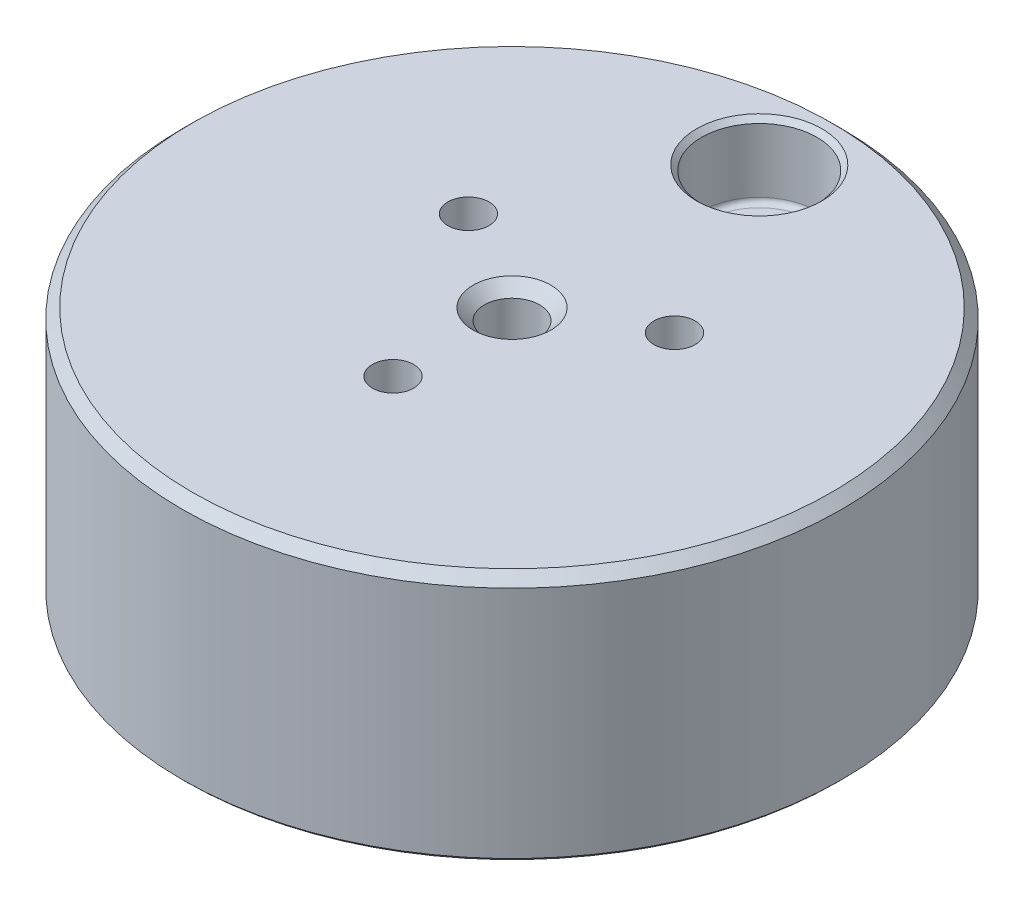
ISO-10303-21;
HEADER;
FILE_DESCRIPTION(('STEP AP214'),'2;1');
FILE_NAME('part.step','',(''),(''),'','','');
FILE_SCHEMA(('AUTOMOTIVE_DESIGN { 1 0 10303 214 1 1 1 1 }'));
ENDSEC;
DATA;
#1=APPLICATION_CONTEXT('core data for automotive mechanical design processes');
#2=APPLICATION_PROTOCOL_DEFINITION('international standard','automotive_design',2000,#1);
#3=PRODUCT_CONTEXT('',#1,'mechanical');
#4=PRODUCT('Part','Part','',(#3));
#5=PRODUCT_RELATED_PRODUCT_CATEGORY('part','',(#4));
#6=PRODUCT_DEFINITION_FORMATION('','',#4);
#7=PRODUCT_DEFINITION_CONTEXT('part definition',#1,'design');
#8=PRODUCT_DEFINITION('design','',#6,#7);
#9=PRODUCT_DEFINITION_SHAPE('','',#8);
#10=(LENGTH_UNIT() NAMED_UNIT(*) SI_UNIT(.MILLI.,.METRE.));
#11=(NAMED_UNIT(*) PLANE_ANGLE_UNIT() SI_UNIT($,.RADIAN.));
#12=(NAMED_UNIT(*) SI_UNIT($,.STERADIAN.) SOLID_ANGLE_UNIT());
#13=UNCERTAINTY_MEASURE_WITH_UNIT(LENGTH_MEASURE(1.E-05),#10,'distance_accuracy_value','');
#14=(GEOMETRIC_REPRESENTATION_CONTEXT(3) GLOBAL_UNCERTAINTY_ASSIGNED_CONTEXT((#13)) GLOBAL_UNIT_ASSIGNED_CONTEXT((#10,
#11,#12)) REPRESENTATION_CONTEXT('',''));
#15=CARTESIAN_POINT('',(0.,0.,0.));
#16=DIRECTION('',(0.,0.,1.));
#17=DIRECTION('',(1.,0.,0.));
#18=AXIS2_PLACEMENT_3D('',#15,#16,#17);
#19=CARTESIAN_POINT('',(50.8,38.1,0.));
#20=DIRECTION('',(0.,1.,0.));
#21=DIRECTION('',(0.,0.,1.));
#22=AXIS2_PLACEMENT_3D('',#19,#20,#21);
#23=PLANE('',#22);
#24=CARTESIAN_POINT('',(0.,38.1,-38.1));
#25=DIRECTION('',(0.,1.,0.));
#26=DIRECTION('',(0.,0.,1.));
#27=AXIS2_PLACEMENT_3D('',#24,#25,#26);
#28=CIRCLE('',#27,9.65199999999998);
#29=CARTESIAN_POINT('',(0.,38.1,-28.448));
#30=VERTEX_POINT('',#29);
#31=EDGE_CURVE('E128',#30,#30,#28,.F.);
#32=ORIENTED_EDGE('',*,*,#31,.T.);
#33=EDGE_LOOP('',(#32));
#34=FACE_BOUND('',#33,.T.);
#35=CARTESIAN_POINT('',(0.,38.1,0.));
#36=DIRECTION('',(0.,1.,0.));
#37=DIRECTION('',(0.,0.,1.));
#38=AXIS2_PLACEMENT_3D('',#35,#36,#37);
#39=CIRCLE('',#38,49.276);
#40=CARTESIAN_POINT('',(0.,38.1,49.276));
#41=VERTEX_POINT('',#40);
#42=EDGE_CURVE('E132',#41,#41,#39,.T.);
#43=ORIENTED_EDGE('',*,*,#42,.T.);
#44=EDGE_LOOP('',(#43));
#45=FACE_BOUND('',#44,.T.);
#46=CARTESIAN_POINT('',(0.,38.1,18.3308710467706));
#47=DIRECTION('',(0.,-1.,0.));
#48=DIRECTION('',(0.,0.,-1.));
#49=AXIS2_PLACEMENT_3D('',#46,#47,#48);
#50=CIRCLE('',#49,3.175);
#51=CARTESIAN_POINT('',(0.,38.1,15.1558710467706));
#52=VERTEX_POINT('',#51);
#53=EDGE_CURVE('E136',#52,#52,#50,.T.);
#54=ORIENTED_EDGE('',*,*,#53,.T.);
#55=EDGE_LOOP('',(#54));
#56=FACE_BOUND('',#55,.T.);
#57=CARTESIAN_POINT('',(15.875,38.1,-9.16543552338532));
#58=DIRECTION('',(0.,-1.,0.));
#59=DIRECTION('',(0.,0.,-1.));
#60=AXIS2_PLACEMENT_3D('',#57,#58,#59);
#61=CIRCLE('',#60,3.175);
#62=CARTESIAN_POINT('',(15.875,38.1,-12.3404355233853));
#63=VERTEX_POINT('',#62);
#64=EDGE_CURVE('E140',#63,#63,#61,.T.);
#65=ORIENTED_EDGE('',*,*,#64,.T.);
#66=EDGE_LOOP('',(#65));
#67=FACE_BOUND('',#66,.T.);
#68=CARTESIAN_POINT('',(-15.875,38.1,-9.16543552338531));
#69=DIRECTION('',(0.,-1.,0.));
#70=DIRECTION('',(0.,0.,-1.));
#71=AXIS2_PLACEMENT_3D('',#68,#69,#70);
#72=CIRCLE('',#71,3.175);
#73=CARTESIAN_POINT('',(-15.875,38.1,-12.3404355233853));
#74=VERTEX_POINT('',#73);
#75=EDGE_CURVE('E144',#74,#74,#72,.T.);
#76=ORIENTED_EDGE('',*,*,#75,.T.);
#77=EDGE_LOOP('',(#76));
#78=FACE_BOUND('',#77,.T.);
#79=CARTESIAN_POINT('',(0.,38.1,0.));
#80=DIRECTION('',(0.,1.,0.));
#81=DIRECTION('',(0.,0.,1.));
#82=AXIS2_PLACEMENT_3D('',#79,#80,#81);
#83=CIRCLE('',#82,6.);
#84=CARTESIAN_POINT('',(0.,38.1,6.));
#85=VERTEX_POINT('',#84);
#86=EDGE_CURVE('E81',#85,#85,#83,.T.);
#87=ORIENTED_EDGE('',*,*,#86,.F.);
#88=EDGE_LOOP('',(#87));
#89=FACE_BOUND('',#88,.T.);
#90=ADVANCED_FACE('F45',(#34,#45,#56,#67,#78,#89),#23,.T.);
#91=CARTESIAN_POINT('',(0.,0.,0.));
#92=DIRECTION('',(0.,-1.,0.));
#93=DIRECTION('',(0.,0.,-1.));
#94=AXIS2_PLACEMENT_3D('',#91,#92,#93);
#95=CYLINDRICAL_SURFACE('',#94,50.8);
#96=CARTESIAN_POINT('',(0.,0.508000000000002,0.));
#97=DIRECTION('',(0.,-1.,0.));
#98=DIRECTION('',(0.,0.,-1.));
#99=AXIS2_PLACEMENT_3D('',#96,#97,#98);
#100=CIRCLE('',#99,50.8);
#101=CARTESIAN_POINT('',(0.,0.508000000000002,-50.8));
#102=VERTEX_POINT('',#101);
#103=EDGE_CURVE('E414',#102,#102,#100,.F.);
#104=ORIENTED_EDGE('',*,*,#103,.T.);
#105=EDGE_LOOP('',(#104));
#106=FACE_BOUND('',#105,.T.);
#107=CARTESIAN_POINT('',(0.,36.576,0.));
#108=DIRECTION('',(0.,1.,0.));
#109=DIRECTION('',(0.,0.,1.));
#110=AXIS2_PLACEMENT_3D('',#107,#108,#109);
#111=CIRCLE('',#110,50.8);
#112=CARTESIAN_POINT('',(0.,36.576,50.8));
#113=VERTEX_POINT('',#112);
#114=EDGE_CURVE('E444',#113,#113,#111,.F.);
#115=ORIENTED_EDGE('',*,*,#114,.T.);
#116=EDGE_LOOP('',(#115));
#117=FACE_BOUND('',#116,.T.);
#118=ADVANCED_FACE('F119',(#106,#117),#95,.T.);
#119=CARTESIAN_POINT('',(43.3705,0.,0.));
#120=DIRECTION('',(0.,-1.,0.));
#121=DIRECTION('',(0.,0.,-1.));
#122=AXIS2_PLACEMENT_3D('',#119,#120,#121);
#123=PLANE('',#122);
#124=CARTESIAN_POINT('',(0.,0.,0.));
#125=DIRECTION('',(0.,-1.,0.));
#126=DIRECTION('',(0.,0.,-1.));
#127=AXIS2_PLACEMENT_3D('',#124,#125,#126);
#128=CIRCLE('',#127,50.292);
#129=CARTESIAN_POINT('',(0.,0.,-50.292));
#130=VERTEX_POINT('',#129);
#131=EDGE_CURVE('E420',#130,#130,#128,.T.);
#132=ORIENTED_EDGE('',*,*,#131,.T.);
#133=EDGE_LOOP('',(#132));
#134=FACE_BOUND('',#133,.T.);
#135=CARTESIAN_POINT('',(0.,0.,0.));
#136=DIRECTION('',(0.,-1.,0.));
#137=DIRECTION('',(0.,0.,-1.));
#138=AXIS2_PLACEMENT_3D('',#135,#136,#137);
#139=CIRCLE('',#138,43.3705);
#140=CARTESIAN_POINT('',(0.,0.,-43.3705));
#141=VERTEX_POINT('',#140);
#142=EDGE_CURVE('E447',#141,#141,#139,.T.);
#143=ORIENTED_EDGE('',*,*,#142,.F.);
#144=EDGE_LOOP('',(#143));
#145=FACE_BOUND('',#144,.T.);
#146=ADVANCED_FACE('F114',(#134,#145),#123,.T.);
#147=CARTESIAN_POINT('',(0.,0.508,0.));
#148=DIRECTION('',(0.,-1.,0.));
#149=DIRECTION('',(0.,0.,-1.));
#150=AXIS2_PLACEMENT_3D('',#147,#148,#149);
#151=CONICAL_SURFACE('',#150,42.8625,0.78539816339745);
#152=CARTESIAN_POINT('',(-4.64060589067007,2.64355100897605,-40.4616998046912));
#153=CARTESIAN_POINT('',(-4.56332893738266,2.50153740585179,-40.6134955849174));
#154=CARTESIAN_POINT('',(-4.47763013255543,2.36196187655322,-40.7634981195991));
#155=CARTESIAN_POINT('',(-4.28841393065672,2.08871344300625,-41.0585894199494));
#156=CARTESIAN_POINT('',(-4.18483983971216,1.9550610737781,-41.2036607376286));
#157=CARTESIAN_POINT('',(-3.95875535547982,1.69489351378072,-41.4873525873015));
#158=CARTESIAN_POINT('',(-3.83614181849059,1.56842265188528,-41.6259322870686));
#159=CARTESIAN_POINT('',(-3.57210016193709,1.32555291430125,-41.8931760484409));
#160=CARTESIAN_POINT('',(-3.43070211800943,1.20913841918752,-42.0218554517821));
#161=CARTESIAN_POINT('',(-3.12471754165263,0.985495573396562,-42.2699857577702));
#162=CARTESIAN_POINT('',(-2.95961408776439,0.878594096849884,-42.3890999745633));
#163=CARTESIAN_POINT('',(-2.61016632416386,0.680743303261264,-42.6102717270217));
#164=CARTESIAN_POINT('',(-2.42586864279499,0.589756702813005,-42.712369100446));
#165=CARTESIAN_POINT('',(-2.0361080402847,0.425358316483064,-42.8973156578436));
#166=CARTESIAN_POINT('',(-1.83035739683677,0.352246020249332,-42.9798362288704));
#167=CARTESIAN_POINT('',(-1.51054535628467,0.259812845308309,-43.0843510882059));
#168=CARTESIAN_POINT('',(-1.40200237187228,0.231861707571472,-43.11599274656));
#169=CARTESIAN_POINT('',(-1.18178484852256,0.182081560615237,-43.1723886706305));
#170=CARTESIAN_POINT('',(-1.07011160473427,0.160250059344819,-43.1971457398708));
#171=CARTESIAN_POINT('',(-0.843817622936184,0.122948631571604,-43.2394685067645));
#172=CARTESIAN_POINT('',(-0.729185684721436,0.107508446460905,-43.2570005819414));
#173=CARTESIAN_POINT('',(-0.498346145137162,0.0833857628644907,-43.2843997879905));
#174=CARTESIAN_POINT('',(-0.382139188707197,0.0747005786109405,-43.2942699652071));
#175=CARTESIAN_POINT('',(-0.14899720933484,0.0642240271617091,-43.3061766659631));
#176=CARTESIAN_POINT('',(-0.0320620852518503,0.062433640039003,-43.3082120758159));
#177=CARTESIAN_POINT('',(0.20157529498875,0.0657801909259732,-43.3044082126552));
#178=CARTESIAN_POINT('',(0.3182775637497,0.0709167432346047,-43.29856937809));
#179=CARTESIAN_POINT('',(0.544568512898217,0.0875891331044613,-43.2796254535221));
#180=CARTESIAN_POINT('',(0.654215316008429,0.0987836260271323,-43.2669079700271));
#181=CARTESIAN_POINT('',(0.871763716654632,0.127166150551961,-43.2346833630527));
#182=CARTESIAN_POINT('',(0.979664588430404,0.144356610856835,-43.2151734882802));
#183=CARTESIAN_POINT('',(1.19287638930701,0.184464142868869,-43.1696908562866));
#184=CARTESIAN_POINT('',(1.29819002407159,0.207374925645545,-43.1437251966953));
#185=CARTESIAN_POINT('',(1.50576977395705,0.25863131895366,-43.085691807864));
#186=CARTESIAN_POINT('',(1.608035695216,0.286977274361922,-43.0536236914072));
#187=CARTESIAN_POINT('',(1.79895925734411,0.345666144265505,-42.987305883361));
#188=CARTESIAN_POINT('',(1.88795438030537,0.375525135034855,-42.9535958918201));
#189=CARTESIAN_POINT('',(2.06269022451591,0.43905836199826,-42.8819530389432));
#190=CARTESIAN_POINT('',(2.14843412389262,0.472728737062664,-42.8440244519298));
#191=CARTESIAN_POINT('',(2.41644330780346,0.585798578000148,-42.7168218458808));
#192=CARTESIAN_POINT('',(2.59239976540518,0.672015838775531,-42.6200660290463));
#193=CARTESIAN_POINT('',(2.92711168569456,0.859041505515127,-42.4109243318263));
#194=CARTESIAN_POINT('',(3.08579963990724,0.959903814978348,-42.2984807727254));
#195=CARTESIAN_POINT('',(3.48498950369019,1.24504590479576,-41.9818835414954));
#196=CARTESIAN_POINT('',(3.70930319972655,1.4400297143776,-41.7666558171656));
#197=CARTESIAN_POINT('',(4.00726537500604,1.74904132812186,-41.4282454348491));
#198=CARTESIAN_POINT('',(4.09997814964109,1.85450817992039,-41.3131637315487));
#199=CARTESIAN_POINT('',(4.27322875435711,2.07011999901394,-41.0788313178939));
#200=CARTESIAN_POINT('',(4.35379000016513,2.18025543125907,-40.9595891853055));
#201=CARTESIAN_POINT('',(4.42863601867747,2.29245733979443,-40.8386186324628));
#202=B_SPLINE_CURVE_WITH_KNOTS('',3,(#152,#153,#154,#155,#156,#157,#158,#159,#160,#161,#162,
#163,#164,#165,#166,#167,#168,#169,#170,#171,#172,#173,#174,#175,#176,#177,#178,#179,#180,#181,
#182,#183,#184,#185,#186,#187,#188,#189,#190,#191,#192,#193,#194,#195,#196,#197,#198,#199,#200,
#201),.UNSPECIFIED.,.F.,.F.,(4,2,2,2,2,2,2,2,2,2,2,2,2,2,2,2,2,2,2,2,2,2,2,2,4),(0.,
0.665345807354748,1.33284198837203,2.00408923531038,2.67427442581451,3.3622931851038,
4.04867789900967,4.7458770657125,5.09493333323844,5.44384725016406,5.7943670320891,
6.14474737706694,6.4951775256326,6.84558816259503,7.17804583037861,7.51063831882917,
7.84286675241264,8.17511627379469,8.4741075589841,8.77279861642431,9.42622901047839,
10.0821284750019,11.1763176710546,11.7206129173693,12.2638455381371),.UNSPECIFIED.);
#203=CARTESIAN_POINT('',(-2.23203741932386,0.508000000000002,-42.8043445833333));
#204=VERTEX_POINT('',#203);
#205=CARTESIAN_POINT('',(2.23203741932386,0.508000000000002,-42.8043445833333));
#206=VERTEX_POINT('',#205);
#207=EDGE_CURVE('E58',#204,#206,#202,.T.);
#208=ORIENTED_EDGE('',*,*,#207,.F.);
#209=CARTESIAN_POINT('',(0.,0.508,0.));
#210=DIRECTION('',(0.,-1.,0.));
#211=DIRECTION('',(0.,0.,-1.));
#212=AXIS2_PLACEMENT_3D('',#209,#210,#211);
#213=CIRCLE('',#212,42.8625);
#214=EDGE_CURVE('E91',#206,#204,#213,.T.);
#215=ORIENTED_EDGE('',*,*,#214,.F.);
#216=EDGE_LOOP('',(#208,#215));
#217=FACE_BOUND('',#216,.T.);
#218=ORIENTED_EDGE('',*,*,#142,.T.);
#219=EDGE_LOOP('',(#218));
#220=FACE_BOUND('',#219,.T.);
#221=ADVANCED_FACE('F93',(#217,#220),#151,.F.);
#222=CARTESIAN_POINT('',(0.,0.508000000000001,0.));
#223=DIRECTION('',(0.,-1.,0.));
#224=DIRECTION('',(0.,0.,-1.));
#225=AXIS2_PLACEMENT_3D('',#222,#223,#224);
#226=PLANE('',#225);
#227=CARTESIAN_POINT('',(0.,0.508000000000001,18.3308710467706));
#228=DIRECTION('',(0.,-1.,0.));
#229=DIRECTION('',(0.,0.,-1.));
#230=AXIS2_PLACEMENT_3D('',#227,#228,#229);
#231=CIRCLE('',#230,5.33399999999996);
#232=CARTESIAN_POINT('',(0.,0.508000000000001,12.9968710467707));
#233=VERTEX_POINT('',#232);
#234=EDGE_CURVE('E410',#233,#233,#231,.F.);
#235=ORIENTED_EDGE('',*,*,#234,.T.);
#236=EDGE_LOOP('',(#235));
#237=FACE_BOUND('',#236,.T.);
#238=CARTESIAN_POINT('',(-15.875,0.508000000000001,-9.16543552338531));
#239=DIRECTION('',(0.,-1.,0.));
#240=DIRECTION('',(0.,0.,-1.));
#241=AXIS2_PLACEMENT_3D('',#238,#239,#240);
#242=CIRCLE('',#241,5.334);
#243=CARTESIAN_POINT('',(-15.875,0.508000000000001,-14.4994355233853));
#244=VERTEX_POINT('',#243);
#245=EDGE_CURVE('E417',#244,#244,#242,.F.);
#246=ORIENTED_EDGE('',*,*,#245,.T.);
#247=EDGE_LOOP('',(#246));
#248=FACE_BOUND('',#247,.T.);
#249=CARTESIAN_POINT('',(15.875,0.508000000000001,-9.16543552338532));
#250=DIRECTION('',(0.,-1.,0.));
#251=DIRECTION('',(0.,0.,-1.));
#252=AXIS2_PLACEMENT_3D('',#249,#250,#251);
#253=CIRCLE('',#252,5.334);
#254=CARTESIAN_POINT('',(15.875,0.508000000000001,-14.4994355233853));
#255=VERTEX_POINT('',#254);
#256=EDGE_CURVE('E413',#255,#255,#253,.F.);
#257=ORIENTED_EDGE('',*,*,#256,.T.);
#258=EDGE_LOOP('',(#257));
#259=FACE_BOUND('',#258,.T.);
#260=CARTESIAN_POINT('',(0.,0.508000000000002,-38.1));
#261=DIRECTION('',(0.,-1.,0.));
#262=DIRECTION('',(0.,0.,-1.));
#263=AXIS2_PLACEMENT_3D('',#260,#261,#262);
#264=CIRCLE('',#263,5.207);
#265=EDGE_CURVE('E61',#206,#204,#264,.T.);
#266=ORIENTED_EDGE('',*,*,#265,.F.);
#267=ORIENTED_EDGE('',*,*,#214,.T.);
#268=EDGE_LOOP('',(#266,#267));
#269=FACE_BOUND('',#268,.T.);
#270=ADVANCED_FACE('F107',(#237,#248,#259,#269),#226,.T.);
#271=CARTESIAN_POINT('',(0.,38.1,-38.1));
#272=DIRECTION('',(0.,-1.,0.));
#273=DIRECTION('',(0.,0.,-1.));
#274=AXIS2_PLACEMENT_3D('',#271,#272,#273);
#275=CYLINDRICAL_SURFACE('',#274,8.89000000000001);
#276=CARTESIAN_POINT('',(0.,27.4828,-38.1));
#277=DIRECTION('',(0.,-1.,0.));
#278=DIRECTION('',(0.,0.,-1.));
#279=AXIS2_PLACEMENT_3D('',#276,#277,#278);
#280=CIRCLE('',#279,8.89000000000001);
#281=CARTESIAN_POINT('',(0.,27.4828,-46.99));
#282=VERTEX_POINT('',#281);
#283=EDGE_CURVE('E52',#282,#282,#280,.T.);
#284=ORIENTED_EDGE('',*,*,#283,.T.);
#285=EDGE_LOOP('',(#284));
#286=FACE_BOUND('',#285,.T.);
#287=CARTESIAN_POINT('',(0.,37.338,-38.1));
#288=DIRECTION('',(0.,1.,0.));
#289=DIRECTION('',(0.,0.,1.));
#290=AXIS2_PLACEMENT_3D('',#287,#288,#289);
#291=CIRCLE('',#290,8.89000000000001);
#292=CARTESIAN_POINT('',(0.,37.338,-29.21));
#293=VERTEX_POINT('',#292);
#294=EDGE_CURVE('E438',#293,#293,#291,.T.);
#295=ORIENTED_EDGE('',*,*,#294,.T.);
#296=EDGE_LOOP('',(#295));
#297=FACE_BOUND('',#296,.T.);
#298=ADVANCED_FACE('F104',(#286,#297),#275,.F.);
#299=CARTESIAN_POINT('',(0.,26.67,-46.99));
#300=DIRECTION('',(0.,-1.,0.));
#301=DIRECTION('',(0.,0.,-1.));
#302=AXIS2_PLACEMENT_3D('',#299,#300,#301);
#303=PLANE('',#302);
#304=CARTESIAN_POINT('',(0.,26.67,-38.1));
#305=DIRECTION('',(0.,-1.,0.));
#306=DIRECTION('',(0.,0.,-1.));
#307=AXIS2_PLACEMENT_3D('',#304,#305,#306);
#308=CIRCLE('',#307,8.07720000000001);
#309=CARTESIAN_POINT('',(0.,26.67,-46.1772));
#310=VERTEX_POINT('',#309);
#311=EDGE_CURVE('E13',#310,#310,#308,.F.);
#312=ORIENTED_EDGE('',*,*,#311,.T.);
#313=EDGE_LOOP('',(#312));
#314=FACE_BOUND('',#313,.T.);
#315=CARTESIAN_POINT('',(0.,26.67,-38.1));
#316=DIRECTION('',(0.,-1.,0.));
#317=DIRECTION('',(0.,0.,-1.));
#318=AXIS2_PLACEMENT_3D('',#315,#316,#317);
#319=CIRCLE('',#318,5.207);
#320=CARTESIAN_POINT('',(0.,26.67,-43.307));
#321=VERTEX_POINT('',#320);
#322=EDGE_CURVE('E75',#321,#321,#319,.T.);
#323=ORIENTED_EDGE('',*,*,#322,.T.);
#324=EDGE_LOOP('',(#323));
#325=FACE_BOUND('',#324,.T.);
#326=ADVANCED_FACE('F100',(#314,#325),#303,.F.);
#327=CARTESIAN_POINT('',(0.,38.1,-38.1));
#328=DIRECTION('',(0.,-1.,0.));
#329=DIRECTION('',(0.,0.,-1.));
#330=AXIS2_PLACEMENT_3D('',#327,#328,#329);
#331=CYLINDRICAL_SURFACE('',#330,5.207);
#332=ORIENTED_EDGE('',*,*,#207,.T.);
#333=ORIENTED_EDGE('',*,*,#265,.T.);
#334=EDGE_LOOP('',(#332,#333));
#335=FACE_BOUND('',#334,.T.);
#336=ORIENTED_EDGE('',*,*,#322,.F.);
#337=EDGE_LOOP('',(#336));
#338=FACE_BOUND('',#337,.T.);
#339=ADVANCED_FACE('F69',(#335,#338),#331,.F.);
#340=CARTESIAN_POINT('',(0.,13.6144,0.));
#341=DIRECTION('',(0.,1.,0.));
#342=DIRECTION('',(0.,0.,1.));
#343=AXIS2_PLACEMENT_3D('',#340,#341,#342);
#344=CONICAL_SURFACE('',#343,4.24999999999999,1.02974425867665);
#345=CARTESIAN_POINT('',(0.,11.0607423691329,0.));
#346=VERTEX_POINT('',#345);
#347=VERTEX_LOOP('',#346);
#348=FACE_BOUND('',#347,.T.);
#349=CARTESIAN_POINT('',(0.,13.6144,0.));
#350=DIRECTION('',(0.,1.,0.));
#351=DIRECTION('',(0.,0.,1.));
#352=AXIS2_PLACEMENT_3D('',#349,#350,#351);
#353=CIRCLE('',#352,4.24999999999999);
#354=CARTESIAN_POINT('',(0.,13.6144,4.24999999999999));
#355=VERTEX_POINT('',#354);
#356=EDGE_CURVE('E73',#355,#355,#353,.T.);
#357=ORIENTED_EDGE('',*,*,#356,.T.);
#358=EDGE_LOOP('',(#357));
#359=FACE_BOUND('',#358,.T.);
#360=ADVANCED_FACE('F65',(#348,#359),#344,.F.);
#361=CARTESIAN_POINT('',(0.,38.1,0.));
#362=DIRECTION('',(0.,1.,0.));
#363=DIRECTION('',(0.,0.,1.));
#364=AXIS2_PLACEMENT_3D('',#361,#362,#363);
#365=CYLINDRICAL_SURFACE('',#364,4.24999999999999);
#366=ORIENTED_EDGE('',*,*,#356,.F.);
#367=EDGE_LOOP('',(#366));
#368=FACE_BOUND('',#367,.T.);
#369=CARTESIAN_POINT('',(0.,36.35,0.));
#370=DIRECTION('',(0.,1.,0.));
#371=DIRECTION('',(0.,0.,1.));
#372=AXIS2_PLACEMENT_3D('',#369,#370,#371);
#373=CIRCLE('',#372,4.25);
#374=CARTESIAN_POINT('',(0.,36.35,4.25));
#375=VERTEX_POINT('',#374);
#376=EDGE_CURVE('E76',#375,#375,#373,.T.);
#377=ORIENTED_EDGE('',*,*,#376,.T.);
#378=EDGE_LOOP('',(#377));
#379=FACE_BOUND('',#378,.T.);
#380=ADVANCED_FACE('F68',(#368,#379),#365,.F.);
#381=CARTESIAN_POINT('',(0.,38.1,0.));
#382=DIRECTION('',(0.,1.,0.));
#383=DIRECTION('',(0.,0.,1.));
#384=AXIS2_PLACEMENT_3D('',#381,#382,#383);
#385=CONICAL_SURFACE('',#384,6.,0.785398163397449);
#386=ORIENTED_EDGE('',*,*,#376,.F.);
#387=EDGE_LOOP('',(#386));
#388=FACE_BOUND('',#387,.T.);
#389=ORIENTED_EDGE('',*,*,#86,.T.);
#390=EDGE_LOOP('',(#389));
#391=FACE_BOUND('',#390,.T.);
#392=ADVANCED_FACE('F211',(#388,#391),#385,.F.);
#393=CARTESIAN_POINT('',(-15.875,0.508000000000001,-9.16543552338531));
#394=DIRECTION('',(0.,-1.,0.));
#395=DIRECTION('',(0.,0.,-1.));
#396=AXIS2_PLACEMENT_3D('',#393,#394,#395);
#397=CYLINDRICAL_SURFACE('',#396,5.207);
#398=CARTESIAN_POINT('',(-15.875,0.634999999999996,-9.16543552338531));
#399=DIRECTION('',(0.,-1.,0.));
#400=DIRECTION('',(0.,0.,-1.));
#401=AXIS2_PLACEMENT_3D('',#398,#399,#400);
#402=CIRCLE('',#401,5.207);
#403=CARTESIAN_POINT('',(-15.875,0.634999999999996,-14.3724355233853));
#404=VERTEX_POINT('',#403);
#405=EDGE_CURVE('E427',#404,#404,#402,.T.);
#406=ORIENTED_EDGE('',*,*,#405,.T.);
#407=EDGE_LOOP('',(#406));
#408=FACE_BOUND('',#407,.T.);
#409=CARTESIAN_POINT('',(-15.875,6.858,-9.16543552338531));
#410=DIRECTION('',(0.,-1.,0.));
#411=DIRECTION('',(0.,0.,-1.));
#412=AXIS2_PLACEMENT_3D('',#409,#410,#411);
#413=CIRCLE('',#412,5.207);
#414=CARTESIAN_POINT('',(-15.875,6.858,-14.3724355233853));
#415=VERTEX_POINT('',#414);
#416=EDGE_CURVE('E148',#415,#415,#413,.T.);
#417=ORIENTED_EDGE('',*,*,#416,.F.);
#418=EDGE_LOOP('',(#417));
#419=FACE_BOUND('',#418,.T.);
#420=ADVANCED_FACE('F207',(#408,#419),#397,.F.);
#421=CARTESIAN_POINT('',(-12.7,6.858,-9.16543552338531));
#422=DIRECTION('',(0.,1.,0.));
#423=DIRECTION('',(0.,0.,1.));
#424=AXIS2_PLACEMENT_3D('',#421,#422,#423);
#425=PLANE('',#424);
#426=CARTESIAN_POINT('',(-15.875,6.858,-9.16543552338531));
#427=DIRECTION('',(0.,-1.,0.));
#428=DIRECTION('',(0.,0.,-1.));
#429=AXIS2_PLACEMENT_3D('',#426,#427,#428);
#430=CIRCLE('',#429,3.175);
#431=CARTESIAN_POINT('',(-15.875,6.858,-12.3404355233853));
#432=VERTEX_POINT('',#431);
#433=EDGE_CURVE('E150',#432,#432,#430,.T.);
#434=ORIENTED_EDGE('',*,*,#433,.F.);
#435=EDGE_LOOP('',(#434));
#436=FACE_BOUND('',#435,.T.);
#437=ORIENTED_EDGE('',*,*,#416,.T.);
#438=EDGE_LOOP('',(#437));
#439=FACE_BOUND('',#438,.T.);
#440=ADVANCED_FACE('F203',(#436,#439),#425,.F.);
#441=CARTESIAN_POINT('',(-15.875,0.508000000000001,-9.16543552338531));
#442=DIRECTION('',(0.,-1.,0.));
#443=DIRECTION('',(0.,0.,-1.));
#444=AXIS2_PLACEMENT_3D('',#441,#442,#443);
#445=CYLINDRICAL_SURFACE('',#444,3.175);
#446=ORIENTED_EDGE('',*,*,#75,.F.);
#447=EDGE_LOOP('',(#446));
#448=FACE_BOUND('',#447,.T.);
#449=ORIENTED_EDGE('',*,*,#433,.T.);
#450=EDGE_LOOP('',(#449));
#451=FACE_BOUND('',#450,.T.);
#452=ADVANCED_FACE('F199',(#448,#451),#445,.F.);
#453=CARTESIAN_POINT('',(15.875,0.508000000000001,-9.16543552338532));
#454=DIRECTION('',(0.,-1.,0.));
#455=DIRECTION('',(0.,0.,-1.));
#456=AXIS2_PLACEMENT_3D('',#453,#454,#455);
#457=CYLINDRICAL_SURFACE('',#456,5.207);
#458=CARTESIAN_POINT('',(15.875,0.634999999999996,-9.16543552338532));
#459=DIRECTION('',(0.,-1.,0.));
#460=DIRECTION('',(0.,0.,-1.));
#461=AXIS2_PLACEMENT_3D('',#458,#459,#460);
#462=CIRCLE('',#461,5.207);
#463=CARTESIAN_POINT('',(15.875,0.634999999999996,-14.3724355233853));
#464=VERTEX_POINT('',#463);
#465=EDGE_CURVE('E430',#464,#464,#462,.T.);
#466=ORIENTED_EDGE('',*,*,#465,.T.);
#467=EDGE_LOOP('',(#466));
#468=FACE_BOUND('',#467,.T.);
#469=CARTESIAN_POINT('',(15.875,6.858,-9.16543552338532));
#470=DIRECTION('',(0.,-1.,0.));
#471=DIRECTION('',(0.,0.,-1.));
#472=AXIS2_PLACEMENT_3D('',#469,#470,#471);
#473=CIRCLE('',#472,5.207);
#474=CARTESIAN_POINT('',(15.875,6.858,-14.3724355233853));
#475=VERTEX_POINT('',#474);
#476=EDGE_CURVE('E156',#475,#475,#473,.T.);
#477=ORIENTED_EDGE('',*,*,#476,.F.);
#478=EDGE_LOOP('',(#477));
#479=FACE_BOUND('',#478,.T.);
#480=ADVANCED_FACE('F195',(#468,#479),#457,.F.);
#481=CARTESIAN_POINT('',(19.05,6.858,-9.16543552338532));
#482=DIRECTION('',(0.,1.,0.));
#483=DIRECTION('',(0.,0.,1.));
#484=AXIS2_PLACEMENT_3D('',#481,#482,#483);
#485=PLANE('',#484);
#486=CARTESIAN_POINT('',(15.875,6.858,-9.16543552338532));
#487=DIRECTION('',(0.,-1.,0.));
#488=DIRECTION('',(0.,0.,-1.));
#489=AXIS2_PLACEMENT_3D('',#486,#487,#488);
#490=CIRCLE('',#489,3.175);
#491=CARTESIAN_POINT('',(15.875,6.858,-12.3404355233853));
#492=VERTEX_POINT('',#491);
#493=EDGE_CURVE('E159',#492,#492,#490,.T.);
#494=ORIENTED_EDGE('',*,*,#493,.F.);
#495=EDGE_LOOP('',(#494));
#496=FACE_BOUND('',#495,.T.);
#497=ORIENTED_EDGE('',*,*,#476,.T.);
#498=EDGE_LOOP('',(#497));
#499=FACE_BOUND('',#498,.T.);
#500=ADVANCED_FACE('F187',(#496,#499),#485,.F.);
#501=CARTESIAN_POINT('',(15.875,0.508000000000001,-9.16543552338532));
#502=DIRECTION('',(0.,-1.,0.));
#503=DIRECTION('',(0.,0.,-1.));
#504=AXIS2_PLACEMENT_3D('',#501,#502,#503);
#505=CYLINDRICAL_SURFACE('',#504,3.175);
#506=ORIENTED_EDGE('',*,*,#64,.F.);
#507=EDGE_LOOP('',(#506));
#508=FACE_BOUND('',#507,.T.);
#509=ORIENTED_EDGE('',*,*,#493,.T.);
#510=EDGE_LOOP('',(#509));
#511=FACE_BOUND('',#510,.T.);
#512=ADVANCED_FACE('F181',(#508,#511),#505,.F.);
#513=CARTESIAN_POINT('',(0.,0.508000000000001,18.3308710467706));
#514=DIRECTION('',(0.,-1.,0.));
#515=DIRECTION('',(0.,0.,-1.));
#516=AXIS2_PLACEMENT_3D('',#513,#514,#515);
#517=CYLINDRICAL_SURFACE('',#516,5.207);
#518=CARTESIAN_POINT('',(0.,0.634999999999954,18.3308710467706));
#519=DIRECTION('',(0.,-1.,0.));
#520=DIRECTION('',(0.,0.,-1.));
#521=AXIS2_PLACEMENT_3D('',#518,#519,#520);
#522=CIRCLE('',#521,5.207);
#523=CARTESIAN_POINT('',(0.,0.634999999999954,13.1238710467706));
#524=VERTEX_POINT('',#523);
#525=EDGE_CURVE('E412',#524,#524,#522,.T.);
#526=ORIENTED_EDGE('',*,*,#525,.T.);
#527=EDGE_LOOP('',(#526));
#528=FACE_BOUND('',#527,.T.);
#529=CARTESIAN_POINT('',(0.,6.858,18.3308710467706));
#530=DIRECTION('',(0.,-1.,0.));
#531=DIRECTION('',(0.,0.,-1.));
#532=AXIS2_PLACEMENT_3D('',#529,#530,#531);
#533=CIRCLE('',#532,5.207);
#534=CARTESIAN_POINT('',(0.,6.858,13.1238710467706));
#535=VERTEX_POINT('',#534);
#536=EDGE_CURVE('E163',#535,#535,#533,.T.);
#537=ORIENTED_EDGE('',*,*,#536,.F.);
#538=EDGE_LOOP('',(#537));
#539=FACE_BOUND('',#538,.T.);
#540=ADVANCED_FACE('F176',(#528,#539),#517,.F.);
#541=CARTESIAN_POINT('',(3.17500000000001,6.858,18.3308710467706));
#542=DIRECTION('',(0.,1.,0.));
#543=DIRECTION('',(0.,0.,1.));
#544=AXIS2_PLACEMENT_3D('',#541,#542,#543);
#545=PLANE('',#544);
#546=CARTESIAN_POINT('',(0.,6.858,18.3308710467706));
#547=DIRECTION('',(0.,-1.,0.));
#548=DIRECTION('',(0.,0.,-1.));
#549=AXIS2_PLACEMENT_3D('',#546,#547,#548);
#550=CIRCLE('',#549,3.175);
#551=CARTESIAN_POINT('',(0.,6.858,15.1558710467706));
#552=VERTEX_POINT('',#551);
#553=EDGE_CURVE('E166',#552,#552,#550,.T.);
#554=ORIENTED_EDGE('',*,*,#553,.F.);
#555=EDGE_LOOP('',(#554));
#556=FACE_BOUND('',#555,.T.);
#557=ORIENTED_EDGE('',*,*,#536,.T.);
#558=EDGE_LOOP('',(#557));
#559=FACE_BOUND('',#558,.T.);
#560=ADVANCED_FACE('F173',(#556,#559),#545,.F.);
#561=CARTESIAN_POINT('',(0.,0.508000000000001,18.3308710467706));
#562=DIRECTION('',(0.,-1.,0.));
#563=DIRECTION('',(0.,0.,-1.));
#564=AXIS2_PLACEMENT_3D('',#561,#562,#563);
#565=CYLINDRICAL_SURFACE('',#564,3.175);
#566=ORIENTED_EDGE('',*,*,#53,.F.);
#567=EDGE_LOOP('',(#566));
#568=FACE_BOUND('',#567,.T.);
#569=ORIENTED_EDGE('',*,*,#553,.T.);
#570=EDGE_LOOP('',(#569));
#571=FACE_BOUND('',#570,.T.);
#572=ADVANCED_FACE('F171',(#568,#571),#565,.F.);
#573=CARTESIAN_POINT('',(0.,36.576,0.));
#574=DIRECTION('',(0.,-1.,0.));
#575=DIRECTION('',(0.,0.,-1.));
#576=AXIS2_PLACEMENT_3D('',#573,#574,#575);
#577=CONICAL_SURFACE('',#576,50.8,0.785398163397451);
#578=ORIENTED_EDGE('',*,*,#42,.F.);
#579=EDGE_LOOP('',(#578));
#580=FACE_BOUND('',#579,.T.);
#581=ORIENTED_EDGE('',*,*,#114,.F.);
#582=EDGE_LOOP('',(#581));
#583=FACE_BOUND('',#582,.T.);
#584=ADVANCED_FACE('F266',(#580,#583),#577,.T.);
#585=CARTESIAN_POINT('',(0.,38.1,-38.1));
#586=DIRECTION('',(0.,1.,0.));
#587=DIRECTION('',(0.,0.,1.));
#588=AXIS2_PLACEMENT_3D('',#585,#586,#587);
#589=CONICAL_SURFACE('',#588,9.65199999999998,0.785398163397444);
#590=ORIENTED_EDGE('',*,*,#294,.F.);
#591=EDGE_LOOP('',(#590));
#592=FACE_BOUND('',#591,.T.);
#593=ORIENTED_EDGE('',*,*,#31,.F.);
#594=EDGE_LOOP('',(#593));
#595=FACE_BOUND('',#594,.T.);
#596=ADVANCED_FACE('F274',(#592,#595),#589,.F.);
#597=CARTESIAN_POINT('',(0.,0.,0.));
#598=DIRECTION('',(0.,1.,0.));
#599=DIRECTION('',(0.,0.,1.));
#600=AXIS2_PLACEMENT_3D('',#597,#598,#599);
#601=CONICAL_SURFACE('',#600,50.292,0.785398163397421);
#602=ORIENTED_EDGE('',*,*,#103,.F.);
#603=EDGE_LOOP('',(#602));
#604=FACE_BOUND('',#603,.T.);
#605=ORIENTED_EDGE('',*,*,#131,.F.);
#606=EDGE_LOOP('',(#605));
#607=FACE_BOUND('',#606,.T.);
#608=ADVANCED_FACE('F290',(#604,#607),#601,.T.);
#609=CARTESIAN_POINT('',(0.,0.634999999999954,18.3308710467706));
#610=DIRECTION('',(0.,-1.,0.));
#611=DIRECTION('',(0.,0.,-1.));
#612=AXIS2_PLACEMENT_3D('',#609,#610,#611);
#613=CONICAL_SURFACE('',#612,5.207,0.785398163397489);
#614=ORIENTED_EDGE('',*,*,#234,.F.);
#615=EDGE_LOOP('',(#614));
#616=FACE_BOUND('',#615,.T.);
#617=ORIENTED_EDGE('',*,*,#525,.F.);
#618=EDGE_LOOP('',(#617));
#619=FACE_BOUND('',#618,.T.);
#620=ADVANCED_FACE('F313',(#616,#619),#613,.F.);
#621=CARTESIAN_POINT('',(-15.875,0.634999999999996,-9.16543552338531));
#622=DIRECTION('',(0.,-1.,0.));
#623=DIRECTION('',(0.,0.,-1.));
#624=AXIS2_PLACEMENT_3D('',#621,#622,#623);
#625=CONICAL_SURFACE('',#624,5.207,0.785398163397489);
#626=ORIENTED_EDGE('',*,*,#245,.F.);
#627=EDGE_LOOP('',(#626));
#628=FACE_BOUND('',#627,.T.);
#629=ORIENTED_EDGE('',*,*,#405,.F.);
#630=EDGE_LOOP('',(#629));
#631=FACE_BOUND('',#630,.T.);
#632=ADVANCED_FACE('F384',(#628,#631),#625,.F.);
#633=CARTESIAN_POINT('',(15.875,0.634999999999996,-9.16543552338532));
#634=DIRECTION('',(0.,-1.,0.));
#635=DIRECTION('',(0.,0.,-1.));
#636=AXIS2_PLACEMENT_3D('',#633,#634,#635);
#637=CONICAL_SURFACE('',#636,5.207,0.785398163397489);
#638=ORIENTED_EDGE('',*,*,#256,.F.);
#639=EDGE_LOOP('',(#638));
#640=FACE_BOUND('',#639,.T.);
#641=ORIENTED_EDGE('',*,*,#465,.F.);
#642=EDGE_LOOP('',(#641));
#643=FACE_BOUND('',#642,.T.);
#644=ADVANCED_FACE('F374',(#640,#643),#637,.F.);
#645=CARTESIAN_POINT('',(0.,27.4828,-38.1));
#646=DIRECTION('',(0.,-1.,0.));
#647=DIRECTION('',(0.,0.,-1.));
#648=AXIS2_PLACEMENT_3D('',#645,#646,#647);
#649=TOROIDAL_SURFACE('',#648,8.07720000000001,0.8128);
#650=ORIENTED_EDGE('',*,*,#311,.F.);
#651=EDGE_LOOP('',(#650));
#652=FACE_BOUND('',#651,.T.);
#653=ORIENTED_EDGE('',*,*,#283,.F.);
#654=EDGE_LOOP('',(#653));
#655=FACE_BOUND('',#654,.T.);
#656=ADVANCED_FACE('F370',(#652,#655),#649,.F.);
#657=CLOSED_SHELL('',(#90,#118,#146,#221,#270,#298,#326,#339,#360,#380,#392,#420,#440,#452,#480,
#500,#512,#540,#560,#572,#584,#596,#608,#620,#632,#644,#656));
#658=MANIFOLD_SOLID_BREP('B2',#657);
#659=ADVANCED_BREP_SHAPE_REPRESENTATION('',(#18,#658),#14);
#660=SHAPE_DEFINITION_REPRESENTATION(#9,#659);
ENDSEC;
END-ISO-10303-21;
